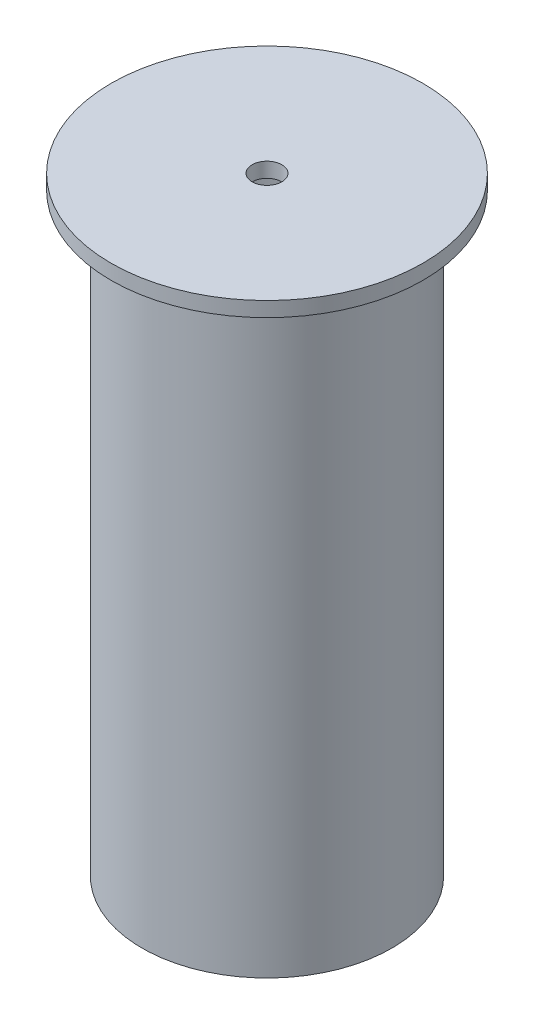
ISO-10303-21;
HEADER;
FILE_DESCRIPTION(('STEP AP214'),'2;1');
FILE_NAME('part.step','',(''),(''),'','','');
FILE_SCHEMA(('AUTOMOTIVE_DESIGN { 1 0 10303 214 1 1 1 1 }'));
ENDSEC;
DATA;
#1=APPLICATION_CONTEXT('core data for automotive mechanical design processes');
#2=APPLICATION_PROTOCOL_DEFINITION('international standard','automotive_design',2000,#1);
#3=PRODUCT_CONTEXT('',#1,'mechanical');
#4=PRODUCT('Part','Part','',(#3));
#5=PRODUCT_RELATED_PRODUCT_CATEGORY('part','',(#4));
#6=PRODUCT_DEFINITION_FORMATION('','',#4);
#7=PRODUCT_DEFINITION_CONTEXT('part definition',#1,'design');
#8=PRODUCT_DEFINITION('design','',#6,#7);
#9=PRODUCT_DEFINITION_SHAPE('','',#8);
#10=(LENGTH_UNIT() NAMED_UNIT(*) SI_UNIT(.MILLI.,.METRE.));
#11=(NAMED_UNIT(*) PLANE_ANGLE_UNIT() SI_UNIT($,.RADIAN.));
#12=(NAMED_UNIT(*) SI_UNIT($,.STERADIAN.) SOLID_ANGLE_UNIT());
#13=UNCERTAINTY_MEASURE_WITH_UNIT(LENGTH_MEASURE(1.E-05),#10,'distance_accuracy_value','');
#14=(GEOMETRIC_REPRESENTATION_CONTEXT(3) GLOBAL_UNCERTAINTY_ASSIGNED_CONTEXT((#13)) GLOBAL_UNIT_ASSIGNED_CONTEXT((#10,
#11,#12)) REPRESENTATION_CONTEXT('',''));
#15=CARTESIAN_POINT('',(0.,0.,0.));
#16=DIRECTION('',(0.,0.,1.));
#17=DIRECTION('',(1.,0.,0.));
#18=AXIS2_PLACEMENT_3D('',#15,#16,#17);
#19=CARTESIAN_POINT('',(0.,0.,0.));
#20=DIRECTION('',(0.,-1.,0.));
#21=DIRECTION('',(0.,0.,-1.));
#22=AXIS2_PLACEMENT_3D('',#19,#20,#21);
#23=CYLINDRICAL_SURFACE('',#22,10.);
#24=CARTESIAN_POINT('',(0.,400.,0.));
#25=DIRECTION('',(0.,-1.,0.));
#26=DIRECTION('',(0.,0.,-1.));
#27=AXIS2_PLACEMENT_3D('',#24,#25,#26);
#28=CIRCLE('',#27,10.);
#29=CARTESIAN_POINT('',(0.,400.,-10.));
#30=VERTEX_POINT('',#29);
#31=EDGE_CURVE('E76',#30,#30,#28,.T.);
#32=ORIENTED_EDGE('',*,*,#31,.T.);
#33=EDGE_LOOP('',(#32));
#34=FACE_BOUND('',#33,.T.);
#35=CARTESIAN_POINT('',(0.,410.,0.));
#36=DIRECTION('',(0.,-1.,0.));
#37=DIRECTION('',(0.,0.,-1.));
#38=AXIS2_PLACEMENT_3D('',#35,#36,#37);
#39=CIRCLE('',#38,10.);
#40=CARTESIAN_POINT('',(0.,410.,-10.));
#41=VERTEX_POINT('',#40);
#42=EDGE_CURVE('E12',#41,#41,#39,.T.);
#43=ORIENTED_EDGE('',*,*,#42,.F.);
#44=EDGE_LOOP('',(#43));
#45=FACE_BOUND('',#44,.T.);
#46=ADVANCED_FACE('F42',(#34,#45),#23,.F.);
#47=CARTESIAN_POINT('',(10.,410.,0.));
#48=DIRECTION('',(0.,1.,0.));
#49=DIRECTION('',(0.,0.,1.));
#50=AXIS2_PLACEMENT_3D('',#47,#48,#49);
#51=PLANE('',#50);
#52=ORIENTED_EDGE('',*,*,#42,.T.);
#53=EDGE_LOOP('',(#52));
#54=FACE_BOUND('',#53,.T.);
#55=CARTESIAN_POINT('',(0.,410.,0.));
#56=DIRECTION('',(0.,-1.,0.));
#57=DIRECTION('',(0.,0.,-1.));
#58=AXIS2_PLACEMENT_3D('',#55,#56,#57);
#59=CIRCLE('',#58,105.);
#60=CARTESIAN_POINT('',(0.,410.,-105.));
#61=VERTEX_POINT('',#60);
#62=EDGE_CURVE('E48',#61,#61,#59,.T.);
#63=ORIENTED_EDGE('',*,*,#62,.F.);
#64=EDGE_LOOP('',(#63));
#65=FACE_BOUND('',#64,.T.);
#66=ADVANCED_FACE('F94',(#54,#65),#51,.T.);
#67=CARTESIAN_POINT('',(0.,0.,0.));
#68=DIRECTION('',(0.,-1.,0.));
#69=DIRECTION('',(0.,0.,-1.));
#70=AXIS2_PLACEMENT_3D('',#67,#68,#69);
#71=CYLINDRICAL_SURFACE('',#70,105.);
#72=ORIENTED_EDGE('',*,*,#62,.T.);
#73=EDGE_LOOP('',(#72));
#74=FACE_BOUND('',#73,.T.);
#75=CARTESIAN_POINT('',(0.,400.,0.));
#76=DIRECTION('',(0.,-1.,0.));
#77=DIRECTION('',(0.,0.,-1.));
#78=AXIS2_PLACEMENT_3D('',#75,#76,#77);
#79=CIRCLE('',#78,105.);
#80=CARTESIAN_POINT('',(0.,400.,-105.));
#81=VERTEX_POINT('',#80);
#82=EDGE_CURVE('E52',#81,#81,#79,.T.);
#83=ORIENTED_EDGE('',*,*,#82,.F.);
#84=EDGE_LOOP('',(#83));
#85=FACE_BOUND('',#84,.T.);
#86=ADVANCED_FACE('F98',(#74,#85),#71,.T.);
#87=CARTESIAN_POINT('',(105.,400.,0.));
#88=DIRECTION('',(0.,-1.,0.));
#89=DIRECTION('',(0.,0.,-1.));
#90=AXIS2_PLACEMENT_3D('',#87,#88,#89);
#91=PLANE('',#90);
#92=ORIENTED_EDGE('',*,*,#82,.T.);
#93=EDGE_LOOP('',(#92));
#94=FACE_BOUND('',#93,.T.);
#95=CARTESIAN_POINT('',(0.,400.,0.));
#96=DIRECTION('',(0.,-1.,0.));
#97=DIRECTION('',(0.,0.,-1.));
#98=AXIS2_PLACEMENT_3D('',#95,#96,#97);
#99=CIRCLE('',#98,84.14);
#100=CARTESIAN_POINT('',(0.,400.,-84.14));
#101=VERTEX_POINT('',#100);
#102=EDGE_CURVE('E56',#101,#101,#99,.T.);
#103=ORIENTED_EDGE('',*,*,#102,.F.);
#104=EDGE_LOOP('',(#103));
#105=FACE_BOUND('',#104,.T.);
#106=ADVANCED_FACE('F102',(#94,#105),#91,.T.);
#107=CARTESIAN_POINT('',(0.,0.,0.));
#108=DIRECTION('',(0.,-1.,0.));
#109=DIRECTION('',(0.,0.,-1.));
#110=AXIS2_PLACEMENT_3D('',#107,#108,#109);
#111=CYLINDRICAL_SURFACE('',#110,84.14);
#112=ORIENTED_EDGE('',*,*,#102,.T.);
#113=EDGE_LOOP('',(#112));
#114=FACE_BOUND('',#113,.T.);
#115=CARTESIAN_POINT('',(0.,0.,0.));
#116=DIRECTION('',(0.,-1.,0.));
#117=DIRECTION('',(0.,0.,-1.));
#118=AXIS2_PLACEMENT_3D('',#115,#116,#117);
#119=CIRCLE('',#118,84.1400000000001);
#120=CARTESIAN_POINT('',(0.,0.,-84.1400000000001));
#121=VERTEX_POINT('',#120);
#122=EDGE_CURVE('E61',#121,#121,#119,.T.);
#123=ORIENTED_EDGE('',*,*,#122,.F.);
#124=EDGE_LOOP('',(#123));
#125=FACE_BOUND('',#124,.T.);
#126=ADVANCED_FACE('F108',(#114,#125),#111,.T.);
#127=CARTESIAN_POINT('',(84.1400000000001,0.,0.));
#128=DIRECTION('',(0.,-1.,0.));
#129=DIRECTION('',(0.,0.,-1.));
#130=AXIS2_PLACEMENT_3D('',#127,#128,#129);
#131=PLANE('',#130);
#132=ORIENTED_EDGE('',*,*,#122,.T.);
#133=EDGE_LOOP('',(#132));
#134=FACE_BOUND('',#133,.T.);
#135=CARTESIAN_POINT('',(0.,0.,0.));
#136=DIRECTION('',(0.,-1.,0.));
#137=DIRECTION('',(0.,0.,-1.));
#138=AXIS2_PLACEMENT_3D('',#135,#136,#137);
#139=CIRCLE('',#138,74.7400000000001);
#140=CARTESIAN_POINT('',(0.,0.,-74.7400000000001));
#141=VERTEX_POINT('',#140);
#142=EDGE_CURVE('E64',#141,#141,#139,.T.);
#143=ORIENTED_EDGE('',*,*,#142,.F.);
#144=EDGE_LOOP('',(#143));
#145=FACE_BOUND('',#144,.T.);
#146=ADVANCED_FACE('F112',(#134,#145),#131,.T.);
#147=CARTESIAN_POINT('',(0.,0.,0.));
#148=DIRECTION('',(0.,-1.,0.));
#149=DIRECTION('',(0.,0.,-1.));
#150=AXIS2_PLACEMENT_3D('',#147,#148,#149);
#151=CYLINDRICAL_SURFACE('',#150,74.7400000000001);
#152=ORIENTED_EDGE('',*,*,#142,.T.);
#153=EDGE_LOOP('',(#152));
#154=FACE_BOUND('',#153,.T.);
#155=CARTESIAN_POINT('',(0.,10.,0.));
#156=DIRECTION('',(0.,-1.,0.));
#157=DIRECTION('',(0.,0.,-1.));
#158=AXIS2_PLACEMENT_3D('',#155,#156,#157);
#159=CIRCLE('',#158,74.7400000000001);
#160=CARTESIAN_POINT('',(0.,10.,-74.7400000000001));
#161=VERTEX_POINT('',#160);
#162=EDGE_CURVE('E67',#161,#161,#159,.T.);
#163=ORIENTED_EDGE('',*,*,#162,.F.);
#164=EDGE_LOOP('',(#163));
#165=FACE_BOUND('',#164,.T.);
#166=ADVANCED_FACE('F116',(#154,#165),#151,.F.);
#167=CARTESIAN_POINT('',(74.7400000000001,10.,0.));
#168=DIRECTION('',(0.,1.,0.));
#169=DIRECTION('',(0.,0.,1.));
#170=AXIS2_PLACEMENT_3D('',#167,#168,#169);
#171=PLANE('',#170);
#172=ORIENTED_EDGE('',*,*,#162,.T.);
#173=EDGE_LOOP('',(#172));
#174=FACE_BOUND('',#173,.T.);
#175=CARTESIAN_POINT('',(0.,10.,0.));
#176=DIRECTION('',(0.,-1.,0.));
#177=DIRECTION('',(0.,0.,-1.));
#178=AXIS2_PLACEMENT_3D('',#175,#176,#177);
#179=CIRCLE('',#178,80.7400000000001);
#180=CARTESIAN_POINT('',(0.,10.,-80.7400000000001));
#181=VERTEX_POINT('',#180);
#182=EDGE_CURVE('E70',#181,#181,#179,.T.);
#183=ORIENTED_EDGE('',*,*,#182,.F.);
#184=EDGE_LOOP('',(#183));
#185=FACE_BOUND('',#184,.T.);
#186=ADVANCED_FACE('F90',(#174,#185),#171,.T.);
#187=CARTESIAN_POINT('',(0.,0.,0.));
#188=DIRECTION('',(0.,-1.,0.));
#189=DIRECTION('',(0.,0.,-1.));
#190=AXIS2_PLACEMENT_3D('',#187,#188,#189);
#191=CYLINDRICAL_SURFACE('',#190,80.7400000000001);
#192=ORIENTED_EDGE('',*,*,#182,.T.);
#193=EDGE_LOOP('',(#192));
#194=FACE_BOUND('',#193,.T.);
#195=CARTESIAN_POINT('',(0.,400.,0.));
#196=DIRECTION('',(0.,-1.,0.));
#197=DIRECTION('',(0.,0.,-1.));
#198=AXIS2_PLACEMENT_3D('',#195,#196,#197);
#199=CIRCLE('',#198,80.7400000000001);
#200=CARTESIAN_POINT('',(0.,400.,-80.7400000000001));
#201=VERTEX_POINT('',#200);
#202=EDGE_CURVE('E73',#201,#201,#199,.T.);
#203=ORIENTED_EDGE('',*,*,#202,.F.);
#204=EDGE_LOOP('',(#203));
#205=FACE_BOUND('',#204,.T.);
#206=ADVANCED_FACE('F84',(#194,#205),#191,.F.);
#207=CARTESIAN_POINT('',(80.7400000000001,400.,0.));
#208=DIRECTION('',(0.,-1.,0.));
#209=DIRECTION('',(0.,0.,-1.));
#210=AXIS2_PLACEMENT_3D('',#207,#208,#209);
#211=PLANE('',#210);
#212=ORIENTED_EDGE('',*,*,#202,.T.);
#213=EDGE_LOOP('',(#212));
#214=FACE_BOUND('',#213,.T.);
#215=ORIENTED_EDGE('',*,*,#31,.F.);
#216=EDGE_LOOP('',(#215));
#217=FACE_BOUND('',#216,.T.);
#218=ADVANCED_FACE('F82',(#214,#217),#211,.T.);
#219=CLOSED_SHELL('',(#46,#66,#86,#106,#126,#146,#166,#186,#206,#218));
#220=MANIFOLD_SOLID_BREP('B2',#219);
#221=ADVANCED_BREP_SHAPE_REPRESENTATION('',(#18,#220),#14);
#222=SHAPE_DEFINITION_REPRESENTATION(#9,#221);
ENDSEC;
END-ISO-10303-21;
